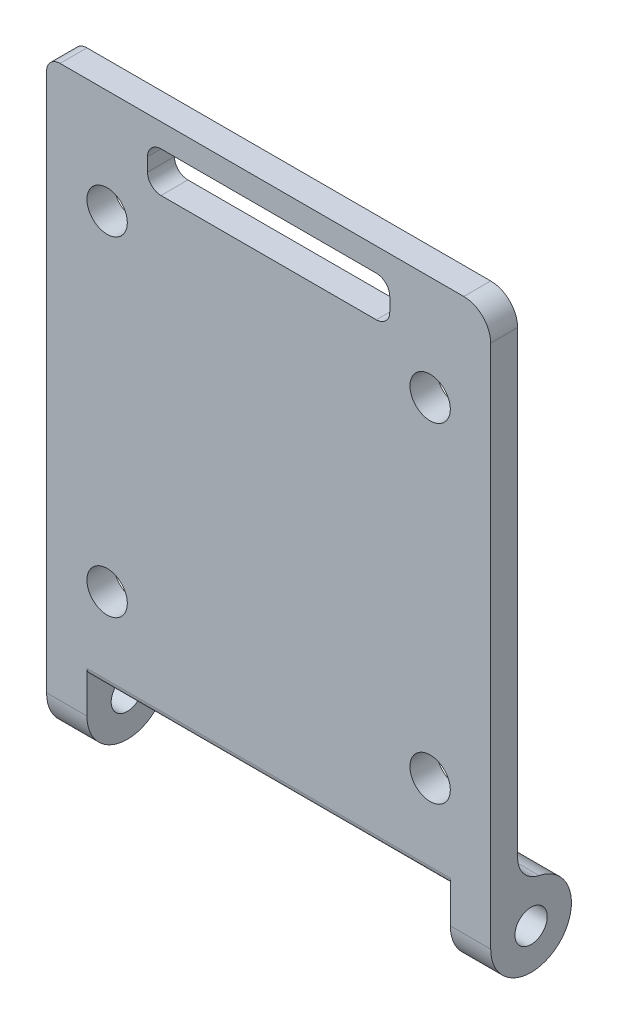
ISO-10303-21;
HEADER;
FILE_DESCRIPTION(('STEP AP214'),'2;1');
FILE_NAME('part.step','',(''),(''),'','','');
FILE_SCHEMA(('AUTOMOTIVE_DESIGN { 1 0 10303 214 1 1 1 1 }'));
ENDSEC;
DATA;
#1=APPLICATION_CONTEXT('core data for automotive mechanical design processes');
#2=APPLICATION_PROTOCOL_DEFINITION('international standard','automotive_design',2000,#1);
#3=PRODUCT_CONTEXT('',#1,'mechanical');
#4=PRODUCT('Part','Part','',(#3));
#5=PRODUCT_RELATED_PRODUCT_CATEGORY('part','',(#4));
#6=PRODUCT_DEFINITION_FORMATION('','',#4);
#7=PRODUCT_DEFINITION_CONTEXT('part definition',#1,'design');
#8=PRODUCT_DEFINITION('design','',#6,#7);
#9=PRODUCT_DEFINITION_SHAPE('','',#8);
#10=(LENGTH_UNIT() NAMED_UNIT(*) SI_UNIT(.MILLI.,.METRE.));
#11=(NAMED_UNIT(*) PLANE_ANGLE_UNIT() SI_UNIT($,.RADIAN.));
#12=(NAMED_UNIT(*) SI_UNIT($,.STERADIAN.) SOLID_ANGLE_UNIT());
#13=UNCERTAINTY_MEASURE_WITH_UNIT(LENGTH_MEASURE(1.E-05),#10,'distance_accuracy_value','');
#14=(GEOMETRIC_REPRESENTATION_CONTEXT(3) GLOBAL_UNCERTAINTY_ASSIGNED_CONTEXT((#13)) GLOBAL_UNIT_ASSIGNED_CONTEXT((#10,
#11,#12)) REPRESENTATION_CONTEXT('',''));
#15=CARTESIAN_POINT('',(0.,0.,0.));
#16=DIRECTION('',(0.,0.,1.));
#17=DIRECTION('',(1.,0.,0.));
#18=AXIS2_PLACEMENT_3D('',#15,#16,#17);
#19=CARTESIAN_POINT('',(0.,0.,-1.));
#20=DIRECTION('',(0.,0.,1.));
#21=DIRECTION('',(1.,0.,0.));
#22=AXIS2_PLACEMENT_3D('',#19,#20,#21);
#23=PLANE('',#22);
#24=CARTESIAN_POINT('',(-12.,-12.25,-1.));
#25=DIRECTION('',(0.,0.,1.));
#26=DIRECTION('',(1.,0.,0.));
#27=AXIS2_PLACEMENT_3D('',#24,#25,#26);
#28=CIRCLE('',#27,1.5);
#29=CARTESIAN_POINT('',(-10.5,-12.25,-1.));
#30=VERTEX_POINT('',#29);
#31=EDGE_CURVE('E409',#30,#30,#28,.T.);
#32=ORIENTED_EDGE('',*,*,#31,.T.);
#33=EDGE_LOOP('',(#32));
#34=FACE_BOUND('',#33,.T.);
#35=CARTESIAN_POINT('',(12.,-12.25,-1.));
#36=DIRECTION('',(0.,0.,1.));
#37=DIRECTION('',(1.,0.,0.));
#38=AXIS2_PLACEMENT_3D('',#35,#36,#37);
#39=CIRCLE('',#38,1.5);
#40=CARTESIAN_POINT('',(13.5,-12.25,-1.));
#41=VERTEX_POINT('',#40);
#42=EDGE_CURVE('E405',#41,#41,#39,.T.);
#43=ORIENTED_EDGE('',*,*,#42,.T.);
#44=EDGE_LOOP('',(#43));
#45=FACE_BOUND('',#44,.T.);
#46=CARTESIAN_POINT('',(12.,12.25,-1.));
#47=DIRECTION('',(0.,0.,1.));
#48=DIRECTION('',(1.,0.,0.));
#49=AXIS2_PLACEMENT_3D('',#46,#47,#48);
#50=CIRCLE('',#49,1.5);
#51=CARTESIAN_POINT('',(13.5,12.25,-1.));
#52=VERTEX_POINT('',#51);
#53=EDGE_CURVE('E401',#52,#52,#50,.T.);
#54=ORIENTED_EDGE('',*,*,#53,.T.);
#55=EDGE_LOOP('',(#54));
#56=FACE_BOUND('',#55,.T.);
#57=CARTESIAN_POINT('',(-12.,12.25,-1.));
#58=DIRECTION('',(0.,0.,1.));
#59=DIRECTION('',(1.,0.,0.));
#60=AXIS2_PLACEMENT_3D('',#57,#58,#59);
#61=CIRCLE('',#60,1.5);
#62=CARTESIAN_POINT('',(-10.5,12.25,-1.));
#63=VERTEX_POINT('',#62);
#64=EDGE_CURVE('E397',#63,#63,#61,.T.);
#65=ORIENTED_EDGE('',*,*,#64,.T.);
#66=EDGE_LOOP('',(#65));
#67=FACE_BOUND('',#66,.T.);
#68=DIRECTION('',(0.,-1.,0.));
#69=VECTOR('',#68,1.);
#70=CARTESIAN_POINT('',(-9.,0.,-1.));
#71=LINE('',#70,#69);
#72=CARTESIAN_POINT('',(-9.,17.25,-1.));
#73=VERTEX_POINT('',#72);
#74=CARTESIAN_POINT('',(-9.,16.25,-1.));
#75=VERTEX_POINT('',#74);
#76=EDGE_CURVE('E389',#73,#75,#71,.T.);
#77=ORIENTED_EDGE('',*,*,#76,.T.);
#78=CARTESIAN_POINT('',(-8.,16.25,-1.));
#79=DIRECTION('',(0.,0.,1.));
#80=DIRECTION('',(1.,0.,0.));
#81=AXIS2_PLACEMENT_3D('',#78,#79,#80);
#82=CIRCLE('',#81,1.);
#83=CARTESIAN_POINT('',(-8.,15.25,-1.));
#84=VERTEX_POINT('',#83);
#85=EDGE_CURVE('E238',#75,#84,#82,.T.);
#86=ORIENTED_EDGE('',*,*,#85,.T.);
#87=DIRECTION('',(1.,0.,0.));
#88=VECTOR('',#87,1.);
#89=CARTESIAN_POINT('',(0.,15.25,-1.));
#90=LINE('',#89,#88);
#91=CARTESIAN_POINT('',(8.,15.25,-1.));
#92=VERTEX_POINT('',#91);
#93=EDGE_CURVE('E385',#84,#92,#90,.T.);
#94=ORIENTED_EDGE('',*,*,#93,.T.);
#95=CARTESIAN_POINT('',(8.,16.25,-1.));
#96=DIRECTION('',(0.,0.,1.));
#97=DIRECTION('',(1.,0.,0.));
#98=AXIS2_PLACEMENT_3D('',#95,#96,#97);
#99=CIRCLE('',#98,1.);
#100=CARTESIAN_POINT('',(9.,16.25,-1.));
#101=VERTEX_POINT('',#100);
#102=EDGE_CURVE('E250',#92,#101,#99,.T.);
#103=ORIENTED_EDGE('',*,*,#102,.T.);
#104=DIRECTION('',(0.,1.,0.));
#105=VECTOR('',#104,1.);
#106=CARTESIAN_POINT('',(9.,0.,-1.));
#107=LINE('',#106,#105);
#108=CARTESIAN_POINT('',(9.,17.25,-1.));
#109=VERTEX_POINT('',#108);
#110=EDGE_CURVE('E378',#101,#109,#107,.T.);
#111=ORIENTED_EDGE('',*,*,#110,.T.);
#112=CARTESIAN_POINT('',(8.,17.25,-1.));
#113=DIRECTION('',(0.,0.,1.));
#114=DIRECTION('',(1.,0.,0.));
#115=AXIS2_PLACEMENT_3D('',#112,#113,#114);
#116=CIRCLE('',#115,1.);
#117=CARTESIAN_POINT('',(8.,18.25,-1.));
#118=VERTEX_POINT('',#117);
#119=EDGE_CURVE('E244',#109,#118,#116,.T.);
#120=ORIENTED_EDGE('',*,*,#119,.T.);
#121=DIRECTION('',(-1.,0.,0.));
#122=VECTOR('',#121,1.);
#123=CARTESIAN_POINT('',(0.,18.25,-1.));
#124=LINE('',#123,#122);
#125=CARTESIAN_POINT('',(-8.,18.25,-1.));
#126=VERTEX_POINT('',#125);
#127=EDGE_CURVE('E393',#118,#126,#124,.T.);
#128=ORIENTED_EDGE('',*,*,#127,.T.);
#129=CARTESIAN_POINT('',(-8.,17.25,-1.));
#130=DIRECTION('',(0.,0.,1.));
#131=DIRECTION('',(1.,0.,0.));
#132=AXIS2_PLACEMENT_3D('',#129,#130,#131);
#133=CIRCLE('',#132,1.);
#134=EDGE_CURVE('E232',#126,#73,#133,.T.);
#135=ORIENTED_EDGE('',*,*,#134,.T.);
#136=EDGE_LOOP('',(#77,#86,#94,#103,#111,#120,#128,#135));
#137=FACE_BOUND('',#136,.T.);
#138=DIRECTION('',(1.,0.,0.));
#139=VECTOR('',#138,1.);
#140=CARTESIAN_POINT('',(-17.882013353342,-16.1010205144336,-1.));
#141=LINE('',#140,#139);
#142=CARTESIAN_POINT('',(-13.5,-16.1010205144336,-1.));
#143=VERTEX_POINT('',#142);
#144=CARTESIAN_POINT('',(13.5,-16.1010205144336,-1.));
#145=VERTEX_POINT('',#144);
#146=EDGE_CURVE('E189',#143,#145,#141,.T.);
#147=ORIENTED_EDGE('',*,*,#146,.F.);
#148=DIRECTION('',(-1.,0.,0.));
#149=VECTOR('',#148,1.);
#150=CARTESIAN_POINT('',(0.,-16.1010205144336,-1.));
#151=LINE('',#150,#149);
#152=CARTESIAN_POINT('',(-16.5,-16.1010205144336,-1.));
#153=VERTEX_POINT('',#152);
#154=EDGE_CURVE('E206',#143,#153,#151,.T.);
#155=ORIENTED_EDGE('',*,*,#154,.T.);
#156=DIRECTION('',(0.,-1.,0.));
#157=VECTOR('',#156,1.);
#158=CARTESIAN_POINT('',(-16.5,20.,-1.));
#159=LINE('',#158,#157);
#160=CARTESIAN_POINT('',(-16.5,19.,-1.));
#161=VERTEX_POINT('',#160);
#162=EDGE_CURVE('E321',#161,#153,#159,.T.);
#163=ORIENTED_EDGE('',*,*,#162,.F.);
#164=CARTESIAN_POINT('',(-15.5,19.,-1.));
#165=DIRECTION('',(0.,0.,1.));
#166=DIRECTION('',(1.,0.,0.));
#167=AXIS2_PLACEMENT_3D('',#164,#165,#166);
#168=CIRCLE('',#167,1.);
#169=CARTESIAN_POINT('',(-15.5,20.,-1.));
#170=VERTEX_POINT('',#169);
#171=EDGE_CURVE('E265',#161,#170,#168,.F.);
#172=ORIENTED_EDGE('',*,*,#171,.T.);
#173=DIRECTION('',(1.,0.,0.));
#174=VECTOR('',#173,1.);
#175=CARTESIAN_POINT('',(-16.5,20.,-1.));
#176=LINE('',#175,#174);
#177=CARTESIAN_POINT('',(14.5,20.,-1.));
#178=VERTEX_POINT('',#177);
#179=EDGE_CURVE('E316',#170,#178,#176,.T.);
#180=ORIENTED_EDGE('',*,*,#179,.T.);
#181=CARTESIAN_POINT('',(14.5,18.,-1.));
#182=DIRECTION('',(0.,0.,1.));
#183=DIRECTION('',(1.,0.,0.));
#184=AXIS2_PLACEMENT_3D('',#181,#182,#183);
#185=CIRCLE('',#184,2.);
#186=CARTESIAN_POINT('',(16.5,18.,-1.));
#187=VERTEX_POINT('',#186);
#188=EDGE_CURVE('E207',#178,#187,#185,.F.);
#189=ORIENTED_EDGE('',*,*,#188,.T.);
#190=DIRECTION('',(0.,-1.,0.));
#191=VECTOR('',#190,1.);
#192=CARTESIAN_POINT('',(16.5,20.,-1.));
#193=LINE('',#192,#191);
#194=CARTESIAN_POINT('',(16.5,-16.1010205144336,-1.));
#195=VERTEX_POINT('',#194);
#196=EDGE_CURVE('E203',#187,#195,#193,.T.);
#197=ORIENTED_EDGE('',*,*,#196,.T.);
#198=DIRECTION('',(1.,0.,0.));
#199=VECTOR('',#198,1.);
#200=CARTESIAN_POINT('',(0.,-16.1010205144336,-1.));
#201=LINE('',#200,#199);
#202=EDGE_CURVE('E201',#195,#145,#201,.F.);
#203=ORIENTED_EDGE('',*,*,#202,.T.);
#204=EDGE_LOOP('',(#147,#155,#163,#172,#180,#189,#197,#203));
#205=FACE_BOUND('',#204,.T.);
#206=ADVANCED_FACE('F45',(#34,#45,#56,#67,#137,#205),#23,.F.);
#207=CARTESIAN_POINT('',(-16.5,20.,-1.));
#208=DIRECTION('',(-1.,0.,0.));
#209=DIRECTION('',(0.,-1.,0.));
#210=AXIS2_PLACEMENT_3D('',#207,#208,#209);
#211=PLANE('',#210);
#212=DIRECTION('',(0.,-1.,0.));
#213=VECTOR('',#212,1.);
#214=CARTESIAN_POINT('',(-16.5,20.,1.));
#215=LINE('',#214,#213);
#216=CARTESIAN_POINT('',(-16.5,19.,1.));
#217=VERTEX_POINT('',#216);
#218=CARTESIAN_POINT('',(-16.5,-21.,1.));
#219=VERTEX_POINT('',#218);
#220=EDGE_CURVE('E325',#217,#219,#215,.T.);
#221=ORIENTED_EDGE('',*,*,#220,.F.);
#222=DIRECTION('',(0.,0.,1.));
#223=VECTOR('',#222,1.);
#224=CARTESIAN_POINT('',(-16.5,19.,-1.));
#225=LINE('',#224,#223);
#226=EDGE_CURVE('E272',#217,#161,#225,.F.);
#227=ORIENTED_EDGE('',*,*,#226,.T.);
#228=ORIENTED_EDGE('',*,*,#162,.T.);
#229=CARTESIAN_POINT('',(-16.5,-16.1010205144336,-3.));
#230=DIRECTION('',(-1.,0.,0.));
#231=DIRECTION('',(0.,-1.,0.));
#232=AXIS2_PLACEMENT_3D('',#229,#230,#231);
#233=CIRCLE('',#232,2.);
#234=CARTESIAN_POINT('',(-16.5,-18.0606123086602,-2.6));
#235=VERTEX_POINT('',#234);
#236=EDGE_CURVE('E229',#153,#235,#233,.F.);
#237=ORIENTED_EDGE('',*,*,#236,.T.);
#238=CARTESIAN_POINT('',(-16.5,-21.,-2.));
#239=DIRECTION('',(-1.,0.,0.));
#240=DIRECTION('',(0.,0.,1.));
#241=AXIS2_PLACEMENT_3D('',#238,#239,#240);
#242=CIRCLE('',#241,3.);
#243=EDGE_CURVE('E365',#235,#219,#242,.T.);
#244=ORIENTED_EDGE('',*,*,#243,.T.);
#245=EDGE_LOOP('',(#221,#227,#228,#237,#244));
#246=FACE_BOUND('',#245,.T.);
#247=CARTESIAN_POINT('',(-16.5,-21.,-2.));
#248=DIRECTION('',(-1.,0.,0.));
#249=DIRECTION('',(0.,0.,1.));
#250=AXIS2_PLACEMENT_3D('',#247,#248,#249);
#251=CIRCLE('',#250,1.2);
#252=CARTESIAN_POINT('',(-16.5,-21.,-0.8));
#253=VERTEX_POINT('',#252);
#254=EDGE_CURVE('E374',#253,#253,#251,.T.);
#255=ORIENTED_EDGE('',*,*,#254,.F.);
#256=EDGE_LOOP('',(#255));
#257=FACE_BOUND('',#256,.T.);
#258=ADVANCED_FACE('F516',(#246,#257),#211,.T.);
#259=CARTESIAN_POINT('',(-16.5,20.,-1.));
#260=DIRECTION('',(0.,-1.,0.));
#261=DIRECTION('',(0.,0.,-1.));
#262=AXIS2_PLACEMENT_3D('',#259,#260,#261);
#263=PLANE('',#262);
#264=ORIENTED_EDGE('',*,*,#179,.F.);
#265=DIRECTION('',(0.,0.,1.));
#266=VECTOR('',#265,1.);
#267=CARTESIAN_POINT('',(-15.5,20.,1.));
#268=LINE('',#267,#266);
#269=CARTESIAN_POINT('',(-15.5,20.,1.));
#270=VERTEX_POINT('',#269);
#271=EDGE_CURVE('E281',#170,#270,#268,.T.);
#272=ORIENTED_EDGE('',*,*,#271,.T.);
#273=DIRECTION('',(1.,0.,0.));
#274=VECTOR('',#273,1.);
#275=CARTESIAN_POINT('',(-16.5,20.,1.));
#276=LINE('',#275,#274);
#277=CARTESIAN_POINT('',(14.5,20.,1.));
#278=VERTEX_POINT('',#277);
#279=EDGE_CURVE('E317',#270,#278,#276,.T.);
#280=ORIENTED_EDGE('',*,*,#279,.T.);
#281=DIRECTION('',(0.,0.,1.));
#282=VECTOR('',#281,1.);
#283=CARTESIAN_POINT('',(14.5,20.,-1.));
#284=LINE('',#283,#282);
#285=EDGE_CURVE('E285',#278,#178,#284,.F.);
#286=ORIENTED_EDGE('',*,*,#285,.T.);
#287=EDGE_LOOP('',(#264,#272,#280,#286));
#288=FACE_BOUND('',#287,.T.);
#289=ADVANCED_FACE('F526',(#288),#263,.F.);
#290=CARTESIAN_POINT('',(16.5,20.,-1.));
#291=DIRECTION('',(-1.,0.,0.));
#292=DIRECTION('',(0.,-1.,0.));
#293=AXIS2_PLACEMENT_3D('',#290,#291,#292);
#294=PLANE('',#293);
#295=ORIENTED_EDGE('',*,*,#196,.F.);
#296=DIRECTION('',(0.,0.,1.));
#297=VECTOR('',#296,1.);
#298=CARTESIAN_POINT('',(16.5,18.,-1.));
#299=LINE('',#298,#297);
#300=CARTESIAN_POINT('',(16.5,18.,1.));
#301=VERTEX_POINT('',#300);
#302=EDGE_CURVE('E256',#187,#301,#299,.T.);
#303=ORIENTED_EDGE('',*,*,#302,.T.);
#304=DIRECTION('',(0.,-1.,0.));
#305=VECTOR('',#304,1.);
#306=CARTESIAN_POINT('',(16.5,20.,1.));
#307=LINE('',#306,#305);
#308=CARTESIAN_POINT('',(16.5,-21.,1.));
#309=VERTEX_POINT('',#308);
#310=EDGE_CURVE('E322',#301,#309,#307,.T.);
#311=ORIENTED_EDGE('',*,*,#310,.T.);
#312=CARTESIAN_POINT('',(16.5,-21.,-2.));
#313=DIRECTION('',(1.,0.,0.));
#314=DIRECTION('',(0.,0.,-1.));
#315=AXIS2_PLACEMENT_3D('',#312,#313,#314);
#316=CIRCLE('',#315,3.);
#317=CARTESIAN_POINT('',(16.5,-18.0606123086602,-2.6));
#318=VERTEX_POINT('',#317);
#319=EDGE_CURVE('E342',#309,#318,#316,.T.);
#320=ORIENTED_EDGE('',*,*,#319,.T.);
#321=CARTESIAN_POINT('',(16.5,-16.1010205144336,-3.));
#322=DIRECTION('',(-1.,0.,0.));
#323=DIRECTION('',(0.,-1.,0.));
#324=AXIS2_PLACEMENT_3D('',#321,#322,#323);
#325=CIRCLE('',#324,2.);
#326=EDGE_CURVE('E215',#318,#195,#325,.T.);
#327=ORIENTED_EDGE('',*,*,#326,.T.);
#328=EDGE_LOOP('',(#295,#303,#311,#320,#327));
#329=FACE_BOUND('',#328,.T.);
#330=CARTESIAN_POINT('',(16.5,-21.,-2.));
#331=DIRECTION('',(1.,0.,0.));
#332=DIRECTION('',(0.,0.,-1.));
#333=AXIS2_PLACEMENT_3D('',#330,#331,#332);
#334=CIRCLE('',#333,1.2);
#335=CARTESIAN_POINT('',(16.5,-21.,-3.2));
#336=VERTEX_POINT('',#335);
#337=EDGE_CURVE('E353',#336,#336,#334,.T.);
#338=ORIENTED_EDGE('',*,*,#337,.F.);
#339=EDGE_LOOP('',(#338));
#340=FACE_BOUND('',#339,.T.);
#341=ADVANCED_FACE('F488',(#329,#340),#294,.F.);
#342=CARTESIAN_POINT('',(0.,0.,1.));
#343=DIRECTION('',(0.,0.,1.));
#344=DIRECTION('',(1.,0.,0.));
#345=AXIS2_PLACEMENT_3D('',#342,#343,#344);
#346=PLANE('',#345);
#347=DIRECTION('',(0.,1.,0.));
#348=VECTOR('',#347,1.);
#349=CARTESIAN_POINT('',(9.,15.25,1.));
#350=LINE('',#349,#348);
#351=CARTESIAN_POINT('',(9.,16.25,1.));
#352=VERTEX_POINT('',#351);
#353=CARTESIAN_POINT('',(9.,17.25,1.));
#354=VERTEX_POINT('',#353);
#355=EDGE_CURVE('E430',#352,#354,#350,.T.);
#356=ORIENTED_EDGE('',*,*,#355,.F.);
#357=CARTESIAN_POINT('',(8.,16.25,1.));
#358=DIRECTION('',(0.,0.,1.));
#359=DIRECTION('',(1.,0.,0.));
#360=AXIS2_PLACEMENT_3D('',#357,#358,#359);
#361=CIRCLE('',#360,1.);
#362=CARTESIAN_POINT('',(8.,15.25,1.));
#363=VERTEX_POINT('',#362);
#364=EDGE_CURVE('E253',#352,#363,#361,.F.);
#365=ORIENTED_EDGE('',*,*,#364,.T.);
#366=DIRECTION('',(1.,0.,0.));
#367=VECTOR('',#366,1.);
#368=CARTESIAN_POINT('',(-9.,15.25,1.));
#369=LINE('',#368,#367);
#370=CARTESIAN_POINT('',(-8.,15.25,1.));
#371=VERTEX_POINT('',#370);
#372=EDGE_CURVE('E413',#371,#363,#369,.T.);
#373=ORIENTED_EDGE('',*,*,#372,.F.);
#374=CARTESIAN_POINT('',(-8.,16.25,1.));
#375=DIRECTION('',(0.,0.,1.));
#376=DIRECTION('',(1.,0.,0.));
#377=AXIS2_PLACEMENT_3D('',#374,#375,#376);
#378=CIRCLE('',#377,1.);
#379=CARTESIAN_POINT('',(-9.,16.25,1.));
#380=VERTEX_POINT('',#379);
#381=EDGE_CURVE('E241',#371,#380,#378,.F.);
#382=ORIENTED_EDGE('',*,*,#381,.T.);
#383=DIRECTION('',(0.,-1.,0.));
#384=VECTOR('',#383,1.);
#385=CARTESIAN_POINT('',(-9.,15.25,1.));
#386=LINE('',#385,#384);
#387=CARTESIAN_POINT('',(-9.,17.25,1.));
#388=VERTEX_POINT('',#387);
#389=EDGE_CURVE('E434',#388,#380,#386,.T.);
#390=ORIENTED_EDGE('',*,*,#389,.F.);
#391=CARTESIAN_POINT('',(-8.,17.25,1.));
#392=DIRECTION('',(0.,0.,1.));
#393=DIRECTION('',(1.,0.,0.));
#394=AXIS2_PLACEMENT_3D('',#391,#392,#393);
#395=CIRCLE('',#394,1.);
#396=CARTESIAN_POINT('',(-8.,18.25,1.));
#397=VERTEX_POINT('',#396);
#398=EDGE_CURVE('E235',#388,#397,#395,.F.);
#399=ORIENTED_EDGE('',*,*,#398,.T.);
#400=DIRECTION('',(-1.,0.,0.));
#401=VECTOR('',#400,1.);
#402=CARTESIAN_POINT('',(-9.,18.25,1.));
#403=LINE('',#402,#401);
#404=CARTESIAN_POINT('',(8.,18.25,1.));
#405=VERTEX_POINT('',#404);
#406=EDGE_CURVE('E438',#405,#397,#403,.T.);
#407=ORIENTED_EDGE('',*,*,#406,.F.);
#408=CARTESIAN_POINT('',(8.,17.25,1.));
#409=DIRECTION('',(0.,0.,1.));
#410=DIRECTION('',(1.,0.,0.));
#411=AXIS2_PLACEMENT_3D('',#408,#409,#410);
#412=CIRCLE('',#411,1.);
#413=EDGE_CURVE('E247',#405,#354,#412,.F.);
#414=ORIENTED_EDGE('',*,*,#413,.T.);
#415=EDGE_LOOP('',(#356,#365,#373,#382,#390,#399,#407,#414));
#416=FACE_BOUND('',#415,.T.);
#417=CARTESIAN_POINT('',(-12.,12.25,1.));
#418=DIRECTION('',(0.,0.,1.));
#419=DIRECTION('',(1.,0.,0.));
#420=AXIS2_PLACEMENT_3D('',#417,#418,#419);
#421=CIRCLE('',#420,1.5);
#422=CARTESIAN_POINT('',(-10.5,12.25,1.));
#423=VERTEX_POINT('',#422);
#424=EDGE_CURVE('E426',#423,#423,#421,.T.);
#425=ORIENTED_EDGE('',*,*,#424,.F.);
#426=EDGE_LOOP('',(#425));
#427=FACE_BOUND('',#426,.T.);
#428=CARTESIAN_POINT('',(12.,12.25,1.));
#429=DIRECTION('',(0.,0.,1.));
#430=DIRECTION('',(1.,0.,0.));
#431=AXIS2_PLACEMENT_3D('',#428,#429,#430);
#432=CIRCLE('',#431,1.5);
#433=CARTESIAN_POINT('',(13.5,12.25,1.));
#434=VERTEX_POINT('',#433);
#435=EDGE_CURVE('E422',#434,#434,#432,.T.);
#436=ORIENTED_EDGE('',*,*,#435,.F.);
#437=EDGE_LOOP('',(#436));
#438=FACE_BOUND('',#437,.T.);
#439=CARTESIAN_POINT('',(12.,-12.25,1.));
#440=DIRECTION('',(0.,0.,1.));
#441=DIRECTION('',(1.,0.,0.));
#442=AXIS2_PLACEMENT_3D('',#439,#440,#441);
#443=CIRCLE('',#442,1.5);
#444=CARTESIAN_POINT('',(13.5,-12.25,1.));
#445=VERTEX_POINT('',#444);
#446=EDGE_CURVE('E418',#445,#445,#443,.T.);
#447=ORIENTED_EDGE('',*,*,#446,.F.);
#448=EDGE_LOOP('',(#447));
#449=FACE_BOUND('',#448,.T.);
#450=CARTESIAN_POINT('',(-12.,-12.25,1.));
#451=DIRECTION('',(0.,0.,1.));
#452=DIRECTION('',(1.,0.,0.));
#453=AXIS2_PLACEMENT_3D('',#450,#451,#452);
#454=CIRCLE('',#453,1.5);
#455=CARTESIAN_POINT('',(-10.5,-12.25,1.));
#456=VERTEX_POINT('',#455);
#457=EDGE_CURVE('E414',#456,#456,#454,.T.);
#458=ORIENTED_EDGE('',*,*,#457,.F.);
#459=EDGE_LOOP('',(#458));
#460=FACE_BOUND('',#459,.T.);
#461=DIRECTION('',(1.,0.,0.));
#462=VECTOR('',#461,1.);
#463=CARTESIAN_POINT('',(0.,-17.9297517902729,1.));
#464=LINE('',#463,#462);
#465=CARTESIAN_POINT('',(-13.5,-17.9297517902729,1.));
#466=VERTEX_POINT('',#465);
#467=CARTESIAN_POINT('',(13.5,-17.9297517902729,1.));
#468=VERTEX_POINT('',#467);
#469=EDGE_CURVE('E214',#466,#468,#464,.T.);
#470=ORIENTED_EDGE('',*,*,#469,.T.);
#471=DIRECTION('',(0.,-1.,0.));
#472=VECTOR('',#471,1.);
#473=CARTESIAN_POINT('',(13.5,-20.,1.));
#474=LINE('',#473,#472);
#475=CARTESIAN_POINT('',(13.5,-21.,1.));
#476=VERTEX_POINT('',#475);
#477=EDGE_CURVE('E341',#468,#476,#474,.T.);
#478=ORIENTED_EDGE('',*,*,#477,.T.);
#479=DIRECTION('',(1.,0.,0.));
#480=VECTOR('',#479,1.);
#481=CARTESIAN_POINT('',(13.5,-21.,1.));
#482=LINE('',#481,#480);
#483=EDGE_CURVE('E329',#476,#309,#482,.T.);
#484=ORIENTED_EDGE('',*,*,#483,.T.);
#485=ORIENTED_EDGE('',*,*,#310,.F.);
#486=CARTESIAN_POINT('',(14.5,18.,1.));
#487=DIRECTION('',(0.,0.,1.));
#488=DIRECTION('',(1.,0.,0.));
#489=AXIS2_PLACEMENT_3D('',#486,#487,#488);
#490=CIRCLE('',#489,2.);
#491=EDGE_CURVE('E278',#301,#278,#490,.T.);
#492=ORIENTED_EDGE('',*,*,#491,.T.);
#493=ORIENTED_EDGE('',*,*,#279,.F.);
#494=CARTESIAN_POINT('',(-15.5,19.,1.));
#495=DIRECTION('',(0.,0.,1.));
#496=DIRECTION('',(1.,0.,0.));
#497=AXIS2_PLACEMENT_3D('',#494,#495,#496);
#498=CIRCLE('',#497,1.);
#499=EDGE_CURVE('E275',#270,#217,#498,.T.);
#500=ORIENTED_EDGE('',*,*,#499,.T.);
#501=ORIENTED_EDGE('',*,*,#220,.T.);
#502=DIRECTION('',(-1.,0.,0.));
#503=VECTOR('',#502,1.);
#504=CARTESIAN_POINT('',(-13.5,-21.,1.));
#505=LINE('',#504,#503);
#506=CARTESIAN_POINT('',(-13.5,-21.,1.));
#507=VERTEX_POINT('',#506);
#508=EDGE_CURVE('E357',#507,#219,#505,.T.);
#509=ORIENTED_EDGE('',*,*,#508,.F.);
#510=DIRECTION('',(0.,1.,0.));
#511=VECTOR('',#510,1.);
#512=CARTESIAN_POINT('',(-13.5,-20.,1.));
#513=LINE('',#512,#511);
#514=EDGE_CURVE('E364',#507,#466,#513,.T.);
#515=ORIENTED_EDGE('',*,*,#514,.T.);
#516=EDGE_LOOP('',(#470,#478,#484,#485,#492,#493,#500,#501,#509,#515));
#517=FACE_BOUND('',#516,.T.);
#518=ADVANCED_FACE('F484',(#416,#427,#438,#449,#460,#517),#346,.T.);
#519=CARTESIAN_POINT('',(13.5,-21.,-2.));
#520=DIRECTION('',(1.,0.,0.));
#521=DIRECTION('',(0.,0.,-1.));
#522=AXIS2_PLACEMENT_3D('',#519,#520,#521);
#523=CYLINDRICAL_SURFACE('',#522,3.);
#524=CARTESIAN_POINT('',(13.5,-21.,-2.));
#525=DIRECTION('',(1.,0.,0.));
#526=DIRECTION('',(0.,0.,-1.));
#527=AXIS2_PLACEMENT_3D('',#524,#525,#526);
#528=CIRCLE('',#527,3.);
#529=CARTESIAN_POINT('',(13.5,-18.0606123086602,-2.6));
#530=VERTEX_POINT('',#529);
#531=EDGE_CURVE('E346',#476,#530,#528,.T.);
#532=ORIENTED_EDGE('',*,*,#531,.T.);
#533=DIRECTION('',(1.,0.,0.));
#534=VECTOR('',#533,1.);
#535=CARTESIAN_POINT('',(13.5,-18.0606123086602,-2.6));
#536=LINE('',#535,#534);
#537=EDGE_CURVE('E212',#530,#318,#536,.T.);
#538=ORIENTED_EDGE('',*,*,#537,.T.);
#539=ORIENTED_EDGE('',*,*,#319,.F.);
#540=ORIENTED_EDGE('',*,*,#483,.F.);
#541=EDGE_LOOP('',(#532,#538,#539,#540));
#542=FACE_BOUND('',#541,.T.);
#543=ADVANCED_FACE('F487',(#542),#523,.T.);
#544=CARTESIAN_POINT('',(13.5,-21.,-2.));
#545=DIRECTION('',(1.,0.,0.));
#546=DIRECTION('',(0.,0.,-1.));
#547=AXIS2_PLACEMENT_3D('',#544,#545,#546);
#548=PLANE('',#547);
#549=ORIENTED_EDGE('',*,*,#477,.F.);
#550=CARTESIAN_POINT('',(13.5,-17.9297517902729,0.5));
#551=DIRECTION('',(1.,0.,0.));
#552=DIRECTION('',(0.,0.,-1.));
#553=AXIS2_PLACEMENT_3D('',#550,#551,#552);
#554=CIRCLE('',#553,0.5);
#555=CARTESIAN_POINT('',(13.5,-18.157957393352,0.0551155175516785));
#556=VERTEX_POINT('',#555);
#557=EDGE_CURVE('E54',#468,#556,#554,.T.);
#558=ORIENTED_EDGE('',*,*,#557,.T.);
#559=DIRECTION('',(0.,0.889768964896645,-0.456411206158167));
#560=VECTOR('',#559,1.);
#561=CARTESIAN_POINT('',(13.5,-16.1010205144336,-1.));
#562=LINE('',#561,#560);
#563=EDGE_CURVE('E179',#556,#145,#562,.T.);
#564=ORIENTED_EDGE('',*,*,#563,.T.);
#565=CARTESIAN_POINT('',(13.5,-16.1010205144336,-3.));
#566=DIRECTION('',(1.,0.,0.));
#567=DIRECTION('',(0.,0.,-1.));
#568=AXIS2_PLACEMENT_3D('',#565,#566,#567);
#569=CIRCLE('',#568,2.);
#570=EDGE_CURVE('E185',#145,#530,#569,.T.);
#571=ORIENTED_EDGE('',*,*,#570,.T.);
#572=ORIENTED_EDGE('',*,*,#531,.F.);
#573=EDGE_LOOP('',(#549,#558,#564,#571,#572));
#574=FACE_BOUND('',#573,.T.);
#575=CARTESIAN_POINT('',(13.5,-21.,-2.));
#576=DIRECTION('',(1.,0.,0.));
#577=DIRECTION('',(0.,0.,-1.));
#578=AXIS2_PLACEMENT_3D('',#575,#576,#577);
#579=CIRCLE('',#578,1.2);
#580=CARTESIAN_POINT('',(13.5,-21.,-3.2));
#581=VERTEX_POINT('',#580);
#582=EDGE_CURVE('E347',#581,#581,#579,.T.);
#583=ORIENTED_EDGE('',*,*,#582,.T.);
#584=EDGE_LOOP('',(#583));
#585=FACE_BOUND('',#584,.T.);
#586=ADVANCED_FACE('F181',(#574,#585),#548,.F.);
#587=CARTESIAN_POINT('',(13.5,-21.,-2.));
#588=DIRECTION('',(1.,0.,0.));
#589=DIRECTION('',(0.,0.,-1.));
#590=AXIS2_PLACEMENT_3D('',#587,#588,#589);
#591=CYLINDRICAL_SURFACE('',#590,1.2);
#592=ORIENTED_EDGE('',*,*,#582,.F.);
#593=EDGE_LOOP('',(#592));
#594=FACE_BOUND('',#593,.T.);
#595=ORIENTED_EDGE('',*,*,#337,.T.);
#596=EDGE_LOOP('',(#595));
#597=FACE_BOUND('',#596,.T.);
#598=ADVANCED_FACE('F540',(#594,#597),#591,.F.);
#599=CARTESIAN_POINT('',(-13.5,-21.,-2.));
#600=DIRECTION('',(-1.,0.,0.));
#601=DIRECTION('',(0.,0.,1.));
#602=AXIS2_PLACEMENT_3D('',#599,#600,#601);
#603=CYLINDRICAL_SURFACE('',#602,3.);
#604=ORIENTED_EDGE('',*,*,#243,.F.);
#605=DIRECTION('',(-1.,0.,0.));
#606=VECTOR('',#605,1.);
#607=CARTESIAN_POINT('',(-13.5,-18.0606123086602,-2.6));
#608=LINE('',#607,#606);
#609=CARTESIAN_POINT('',(-13.5,-18.0606123086602,-2.6));
#610=VERTEX_POINT('',#609);
#611=EDGE_CURVE('E262',#235,#610,#608,.F.);
#612=ORIENTED_EDGE('',*,*,#611,.T.);
#613=CARTESIAN_POINT('',(-13.5,-21.,-2.));
#614=DIRECTION('',(-1.,0.,0.));
#615=DIRECTION('',(0.,0.,1.));
#616=AXIS2_PLACEMENT_3D('',#613,#614,#615);
#617=CIRCLE('',#616,3.);
#618=EDGE_CURVE('E368',#610,#507,#617,.T.);
#619=ORIENTED_EDGE('',*,*,#618,.T.);
#620=ORIENTED_EDGE('',*,*,#508,.T.);
#621=EDGE_LOOP('',(#604,#612,#619,#620));
#622=FACE_BOUND('',#621,.T.);
#623=ADVANCED_FACE('F538',(#622),#603,.T.);
#624=CARTESIAN_POINT('',(-13.5,-21.,-2.));
#625=DIRECTION('',(-1.,0.,0.));
#626=DIRECTION('',(0.,0.,1.));
#627=AXIS2_PLACEMENT_3D('',#624,#625,#626);
#628=PLANE('',#627);
#629=CARTESIAN_POINT('',(-13.5,-16.1010205144336,-3.));
#630=DIRECTION('',(-1.,0.,0.));
#631=DIRECTION('',(0.,0.,1.));
#632=AXIS2_PLACEMENT_3D('',#629,#630,#631);
#633=CIRCLE('',#632,2.);
#634=EDGE_CURVE('E221',#610,#143,#633,.T.);
#635=ORIENTED_EDGE('',*,*,#634,.T.);
#636=DIRECTION('',(0.,0.889768964896645,-0.456411206158167));
#637=VECTOR('',#636,1.);
#638=CARTESIAN_POINT('',(-13.5,-16.1010205144336,-1.));
#639=LINE('',#638,#637);
#640=CARTESIAN_POINT('',(-13.5,-18.157957393352,0.0551155175516789));
#641=VERTEX_POINT('',#640);
#642=EDGE_CURVE('E188',#641,#143,#639,.T.);
#643=ORIENTED_EDGE('',*,*,#642,.F.);
#644=CARTESIAN_POINT('',(-13.5,-17.9297517902729,0.5));
#645=DIRECTION('',(-1.,0.,0.));
#646=DIRECTION('',(0.,0.,1.));
#647=AXIS2_PLACEMENT_3D('',#644,#645,#646);
#648=CIRCLE('',#647,0.5);
#649=EDGE_CURVE('E12',#641,#466,#648,.T.);
#650=ORIENTED_EDGE('',*,*,#649,.T.);
#651=ORIENTED_EDGE('',*,*,#514,.F.);
#652=ORIENTED_EDGE('',*,*,#618,.F.);
#653=EDGE_LOOP('',(#635,#643,#650,#651,#652));
#654=FACE_BOUND('',#653,.T.);
#655=CARTESIAN_POINT('',(-13.5,-21.,-2.));
#656=DIRECTION('',(-1.,0.,0.));
#657=DIRECTION('',(0.,0.,1.));
#658=AXIS2_PLACEMENT_3D('',#655,#656,#657);
#659=CIRCLE('',#658,1.2);
#660=CARTESIAN_POINT('',(-13.5,-21.,-0.8));
#661=VERTEX_POINT('',#660);
#662=EDGE_CURVE('E369',#661,#661,#659,.T.);
#663=ORIENTED_EDGE('',*,*,#662,.T.);
#664=EDGE_LOOP('',(#663));
#665=FACE_BOUND('',#664,.T.);
#666=ADVANCED_FACE('F504',(#654,#665),#628,.F.);
#667=CARTESIAN_POINT('',(-13.5,-21.,-2.));
#668=DIRECTION('',(-1.,0.,0.));
#669=DIRECTION('',(0.,0.,1.));
#670=AXIS2_PLACEMENT_3D('',#667,#668,#669);
#671=CYLINDRICAL_SURFACE('',#670,1.2);
#672=ORIENTED_EDGE('',*,*,#662,.F.);
#673=EDGE_LOOP('',(#672));
#674=FACE_BOUND('',#673,.T.);
#675=ORIENTED_EDGE('',*,*,#254,.T.);
#676=EDGE_LOOP('',(#675));
#677=FACE_BOUND('',#676,.T.);
#678=ADVANCED_FACE('F546',(#674,#677),#671,.F.);
#679=CARTESIAN_POINT('',(-12.,-12.25,-5.));
#680=DIRECTION('',(0.,0.,1.));
#681=DIRECTION('',(1.,0.,0.));
#682=AXIS2_PLACEMENT_3D('',#679,#680,#681);
#683=CYLINDRICAL_SURFACE('',#682,1.5);
#684=ORIENTED_EDGE('',*,*,#457,.T.);
#685=EDGE_LOOP('',(#684));
#686=FACE_BOUND('',#685,.T.);
#687=ORIENTED_EDGE('',*,*,#31,.F.);
#688=EDGE_LOOP('',(#687));
#689=FACE_BOUND('',#688,.T.);
#690=ADVANCED_FACE('F606',(#686,#689),#683,.F.);
#691=CARTESIAN_POINT('',(12.,-12.25,-5.));
#692=DIRECTION('',(0.,0.,1.));
#693=DIRECTION('',(1.,0.,0.));
#694=AXIS2_PLACEMENT_3D('',#691,#692,#693);
#695=CYLINDRICAL_SURFACE('',#694,1.5);
#696=ORIENTED_EDGE('',*,*,#446,.T.);
#697=EDGE_LOOP('',(#696));
#698=FACE_BOUND('',#697,.T.);
#699=ORIENTED_EDGE('',*,*,#42,.F.);
#700=EDGE_LOOP('',(#699));
#701=FACE_BOUND('',#700,.T.);
#702=ADVANCED_FACE('F602',(#698,#701),#695,.F.);
#703=CARTESIAN_POINT('',(12.,12.25,-5.));
#704=DIRECTION('',(0.,0.,1.));
#705=DIRECTION('',(1.,0.,0.));
#706=AXIS2_PLACEMENT_3D('',#703,#704,#705);
#707=CYLINDRICAL_SURFACE('',#706,1.5);
#708=ORIENTED_EDGE('',*,*,#435,.T.);
#709=EDGE_LOOP('',(#708));
#710=FACE_BOUND('',#709,.T.);
#711=ORIENTED_EDGE('',*,*,#53,.F.);
#712=EDGE_LOOP('',(#711));
#713=FACE_BOUND('',#712,.T.);
#714=ADVANCED_FACE('F598',(#710,#713),#707,.F.);
#715=CARTESIAN_POINT('',(-12.,12.25,-5.));
#716=DIRECTION('',(0.,0.,1.));
#717=DIRECTION('',(1.,0.,0.));
#718=AXIS2_PLACEMENT_3D('',#715,#716,#717);
#719=CYLINDRICAL_SURFACE('',#718,1.5);
#720=ORIENTED_EDGE('',*,*,#424,.T.);
#721=EDGE_LOOP('',(#720));
#722=FACE_BOUND('',#721,.T.);
#723=ORIENTED_EDGE('',*,*,#64,.F.);
#724=EDGE_LOOP('',(#723));
#725=FACE_BOUND('',#724,.T.);
#726=ADVANCED_FACE('F595',(#722,#725),#719,.F.);
#727=CARTESIAN_POINT('',(9.,15.25,-5.));
#728=DIRECTION('',(1.,0.,0.));
#729=DIRECTION('',(0.,0.,-1.));
#730=AXIS2_PLACEMENT_3D('',#727,#728,#729);
#731=PLANE('',#730);
#732=ORIENTED_EDGE('',*,*,#110,.F.);
#733=DIRECTION('',(0.,0.,1.));
#734=VECTOR('',#733,1.);
#735=CARTESIAN_POINT('',(9.,16.25,1.));
#736=LINE('',#735,#734);
#737=EDGE_CURVE('E309',#101,#352,#736,.T.);
#738=ORIENTED_EDGE('',*,*,#737,.T.);
#739=ORIENTED_EDGE('',*,*,#355,.T.);
#740=DIRECTION('',(0.,0.,1.));
#741=VECTOR('',#740,1.);
#742=CARTESIAN_POINT('',(9.,17.25,-1.));
#743=LINE('',#742,#741);
#744=EDGE_CURVE('E313',#354,#109,#743,.F.);
#745=ORIENTED_EDGE('',*,*,#744,.T.);
#746=EDGE_LOOP('',(#732,#738,#739,#745));
#747=FACE_BOUND('',#746,.T.);
#748=ADVANCED_FACE('F450',(#747),#731,.F.);
#749=CARTESIAN_POINT('',(-9.,15.25,-5.));
#750=DIRECTION('',(0.,-1.,0.));
#751=DIRECTION('',(0.,0.,-1.));
#752=AXIS2_PLACEMENT_3D('',#749,#750,#751);
#753=PLANE('',#752);
#754=ORIENTED_EDGE('',*,*,#372,.T.);
#755=DIRECTION('',(0.,0.,1.));
#756=VECTOR('',#755,1.);
#757=CARTESIAN_POINT('',(8.,15.25,-1.));
#758=LINE('',#757,#756);
#759=EDGE_CURVE('E302',#363,#92,#758,.F.);
#760=ORIENTED_EDGE('',*,*,#759,.T.);
#761=ORIENTED_EDGE('',*,*,#93,.F.);
#762=DIRECTION('',(0.,0.,1.));
#763=VECTOR('',#762,1.);
#764=CARTESIAN_POINT('',(-8.,15.25,1.));
#765=LINE('',#764,#763);
#766=EDGE_CURVE('E305',#84,#371,#765,.T.);
#767=ORIENTED_EDGE('',*,*,#766,.T.);
#768=EDGE_LOOP('',(#754,#760,#761,#767));
#769=FACE_BOUND('',#768,.T.);
#770=ADVANCED_FACE('F479',(#769),#753,.F.);
#771=CARTESIAN_POINT('',(-9.,15.25,-5.));
#772=DIRECTION('',(-1.,0.,0.));
#773=DIRECTION('',(0.,0.,1.));
#774=AXIS2_PLACEMENT_3D('',#771,#772,#773);
#775=PLANE('',#774);
#776=ORIENTED_EDGE('',*,*,#389,.T.);
#777=DIRECTION('',(0.,0.,1.));
#778=VECTOR('',#777,1.);
#779=CARTESIAN_POINT('',(-9.,16.25,-1.));
#780=LINE('',#779,#778);
#781=EDGE_CURVE('E288',#380,#75,#780,.F.);
#782=ORIENTED_EDGE('',*,*,#781,.T.);
#783=ORIENTED_EDGE('',*,*,#76,.F.);
#784=DIRECTION('',(0.,0.,1.));
#785=VECTOR('',#784,1.);
#786=CARTESIAN_POINT('',(-9.,17.25,1.));
#787=LINE('',#786,#785);
#788=EDGE_CURVE('E291',#73,#388,#787,.T.);
#789=ORIENTED_EDGE('',*,*,#788,.T.);
#790=EDGE_LOOP('',(#776,#782,#783,#789));
#791=FACE_BOUND('',#790,.T.);
#792=ADVANCED_FACE('F470',(#791),#775,.F.);
#793=CARTESIAN_POINT('',(-9.,18.25,-5.));
#794=DIRECTION('',(0.,1.,0.));
#795=DIRECTION('',(0.,0.,1.));
#796=AXIS2_PLACEMENT_3D('',#793,#794,#795);
#797=PLANE('',#796);
#798=ORIENTED_EDGE('',*,*,#127,.F.);
#799=DIRECTION('',(0.,0.,1.));
#800=VECTOR('',#799,1.);
#801=CARTESIAN_POINT('',(8.,18.25,1.));
#802=LINE('',#801,#800);
#803=EDGE_CURVE('E295',#118,#405,#802,.T.);
#804=ORIENTED_EDGE('',*,*,#803,.T.);
#805=ORIENTED_EDGE('',*,*,#406,.T.);
#806=DIRECTION('',(0.,0.,1.));
#807=VECTOR('',#806,1.);
#808=CARTESIAN_POINT('',(-8.,18.25,-1.));
#809=LINE('',#808,#807);
#810=EDGE_CURVE('E299',#397,#126,#809,.F.);
#811=ORIENTED_EDGE('',*,*,#810,.T.);
#812=EDGE_LOOP('',(#798,#804,#805,#811));
#813=FACE_BOUND('',#812,.T.);
#814=ADVANCED_FACE('F461',(#813),#797,.F.);
#815=CARTESIAN_POINT('',(8.,16.25,-5.));
#816=DIRECTION('',(0.,0.,-1.));
#817=DIRECTION('',(-1.,0.,0.));
#818=AXIS2_PLACEMENT_3D('',#815,#816,#817);
#819=CYLINDRICAL_SURFACE('',#818,1.);
#820=ORIENTED_EDGE('',*,*,#102,.F.);
#821=ORIENTED_EDGE('',*,*,#759,.F.);
#822=ORIENTED_EDGE('',*,*,#364,.F.);
#823=ORIENTED_EDGE('',*,*,#737,.F.);
#824=EDGE_LOOP('',(#820,#821,#822,#823));
#825=FACE_BOUND('',#824,.T.);
#826=ADVANCED_FACE('F483',(#825),#819,.F.);
#827=CARTESIAN_POINT('',(8.,17.25,-5.));
#828=DIRECTION('',(0.,0.,-1.));
#829=DIRECTION('',(-1.,0.,0.));
#830=AXIS2_PLACEMENT_3D('',#827,#828,#829);
#831=CYLINDRICAL_SURFACE('',#830,1.);
#832=ORIENTED_EDGE('',*,*,#119,.F.);
#833=ORIENTED_EDGE('',*,*,#744,.F.);
#834=ORIENTED_EDGE('',*,*,#413,.F.);
#835=ORIENTED_EDGE('',*,*,#803,.F.);
#836=EDGE_LOOP('',(#832,#833,#834,#835));
#837=FACE_BOUND('',#836,.T.);
#838=ADVANCED_FACE('F455',(#837),#831,.F.);
#839=CARTESIAN_POINT('',(-8.,16.25,-5.));
#840=DIRECTION('',(0.,0.,-1.));
#841=DIRECTION('',(-1.,0.,0.));
#842=AXIS2_PLACEMENT_3D('',#839,#840,#841);
#843=CYLINDRICAL_SURFACE('',#842,1.);
#844=ORIENTED_EDGE('',*,*,#85,.F.);
#845=ORIENTED_EDGE('',*,*,#781,.F.);
#846=ORIENTED_EDGE('',*,*,#381,.F.);
#847=ORIENTED_EDGE('',*,*,#766,.F.);
#848=EDGE_LOOP('',(#844,#845,#846,#847));
#849=FACE_BOUND('',#848,.T.);
#850=ADVANCED_FACE('F474',(#849),#843,.F.);
#851=CARTESIAN_POINT('',(-8.,17.25,-5.));
#852=DIRECTION('',(0.,0.,-1.));
#853=DIRECTION('',(-1.,0.,0.));
#854=AXIS2_PLACEMENT_3D('',#851,#852,#853);
#855=CYLINDRICAL_SURFACE('',#854,1.);
#856=ORIENTED_EDGE('',*,*,#134,.F.);
#857=ORIENTED_EDGE('',*,*,#810,.F.);
#858=ORIENTED_EDGE('',*,*,#398,.F.);
#859=ORIENTED_EDGE('',*,*,#788,.F.);
#860=EDGE_LOOP('',(#856,#857,#858,#859));
#861=FACE_BOUND('',#860,.T.);
#862=ADVANCED_FACE('F465',(#861),#855,.F.);
#863=CARTESIAN_POINT('',(-15.5,19.,-1.));
#864=DIRECTION('',(0.,0.,-1.));
#865=DIRECTION('',(-1.,0.,0.));
#866=AXIS2_PLACEMENT_3D('',#863,#864,#865);
#867=CYLINDRICAL_SURFACE('',#866,1.);
#868=ORIENTED_EDGE('',*,*,#171,.F.);
#869=ORIENTED_EDGE('',*,*,#226,.F.);
#870=ORIENTED_EDGE('',*,*,#499,.F.);
#871=ORIENTED_EDGE('',*,*,#271,.F.);
#872=EDGE_LOOP('',(#868,#869,#870,#871));
#873=FACE_BOUND('',#872,.T.);
#874=ADVANCED_FACE('F521',(#873),#867,.T.);
#875=CARTESIAN_POINT('',(-13.5,-16.1010205144336,-3.));
#876=DIRECTION('',(-1.,0.,0.));
#877=DIRECTION('',(0.,0.,1.));
#878=AXIS2_PLACEMENT_3D('',#875,#876,#877);
#879=CYLINDRICAL_SURFACE('',#878,2.);
#880=ORIENTED_EDGE('',*,*,#634,.F.);
#881=ORIENTED_EDGE('',*,*,#611,.F.);
#882=ORIENTED_EDGE('',*,*,#236,.F.);
#883=ORIENTED_EDGE('',*,*,#154,.F.);
#884=EDGE_LOOP('',(#880,#881,#882,#883));
#885=FACE_BOUND('',#884,.T.);
#886=ADVANCED_FACE('F511',(#885),#879,.F.);
#887=CARTESIAN_POINT('',(13.5,-16.1010205144336,-3.));
#888=DIRECTION('',(1.,0.,0.));
#889=DIRECTION('',(0.,0.,-1.));
#890=AXIS2_PLACEMENT_3D('',#887,#888,#889);
#891=CYLINDRICAL_SURFACE('',#890,2.);
#892=ORIENTED_EDGE('',*,*,#570,.F.);
#893=ORIENTED_EDGE('',*,*,#202,.F.);
#894=ORIENTED_EDGE('',*,*,#326,.F.);
#895=ORIENTED_EDGE('',*,*,#537,.F.);
#896=EDGE_LOOP('',(#892,#893,#894,#895));
#897=FACE_BOUND('',#896,.T.);
#898=ADVANCED_FACE('F210',(#897),#891,.F.);
#899=CARTESIAN_POINT('',(14.5,18.,-1.));
#900=DIRECTION('',(0.,0.,1.));
#901=DIRECTION('',(1.,0.,0.));
#902=AXIS2_PLACEMENT_3D('',#899,#900,#901);
#903=CYLINDRICAL_SURFACE('',#902,2.);
#904=ORIENTED_EDGE('',*,*,#188,.F.);
#905=ORIENTED_EDGE('',*,*,#285,.F.);
#906=ORIENTED_EDGE('',*,*,#491,.F.);
#907=ORIENTED_EDGE('',*,*,#302,.F.);
#908=EDGE_LOOP('',(#904,#905,#906,#907));
#909=FACE_BOUND('',#908,.T.);
#910=ADVANCED_FACE('F530',(#909),#903,.T.);
#911=CARTESIAN_POINT('',(-17.882013353342,-16.1010205144336,-1.));
#912=DIRECTION('',(0.,-0.456411206158167,-0.889768964896645));
#913=DIRECTION('',(0.,0.889768964896645,-0.456411206158167));
#914=AXIS2_PLACEMENT_3D('',#911,#912,#913);
#915=PLANE('',#914);
#916=ORIENTED_EDGE('',*,*,#563,.F.);
#917=DIRECTION('',(1.,0.,0.));
#918=VECTOR('',#917,1.);
#919=CARTESIAN_POINT('',(-17.882013353342,-18.157957393352,0.0551155175516787));
#920=LINE('',#919,#918);
#921=EDGE_CURVE('E67',#556,#641,#920,.F.);
#922=ORIENTED_EDGE('',*,*,#921,.T.);
#923=ORIENTED_EDGE('',*,*,#642,.T.);
#924=ORIENTED_EDGE('',*,*,#146,.T.);
#925=EDGE_LOOP('',(#916,#922,#923,#924));
#926=FACE_BOUND('',#925,.T.);
#927=ADVANCED_FACE('F193',(#926),#915,.T.);
#928=CARTESIAN_POINT('',(0.,-17.9297517902729,0.5));
#929=DIRECTION('',(1.,0.,0.));
#930=DIRECTION('',(0.,0.,-1.));
#931=AXIS2_PLACEMENT_3D('',#928,#929,#930);
#932=CYLINDRICAL_SURFACE('',#931,0.5);
#933=ORIENTED_EDGE('',*,*,#649,.F.);
#934=ORIENTED_EDGE('',*,*,#921,.F.);
#935=ORIENTED_EDGE('',*,*,#557,.F.);
#936=ORIENTED_EDGE('',*,*,#469,.F.);
#937=EDGE_LOOP('',(#933,#934,#935,#936));
#938=FACE_BOUND('',#937,.T.);
#939=ADVANCED_FACE('F47',(#938),#932,.T.);
#940=CLOSED_SHELL('',(#206,#258,#289,#341,#518,#543,#586,#598,#623,#666,#678,#690,#702,#714,
#726,#748,#770,#792,#814,#826,#838,#850,#862,#874,#886,#898,#910,#927,#939));
#941=MANIFOLD_SOLID_BREP('B2',#940);
#942=ADVANCED_BREP_SHAPE_REPRESENTATION('',(#18,#941),#14);
#943=SHAPE_DEFINITION_REPRESENTATION(#9,#942);
ENDSEC;
END-ISO-10303-21;
